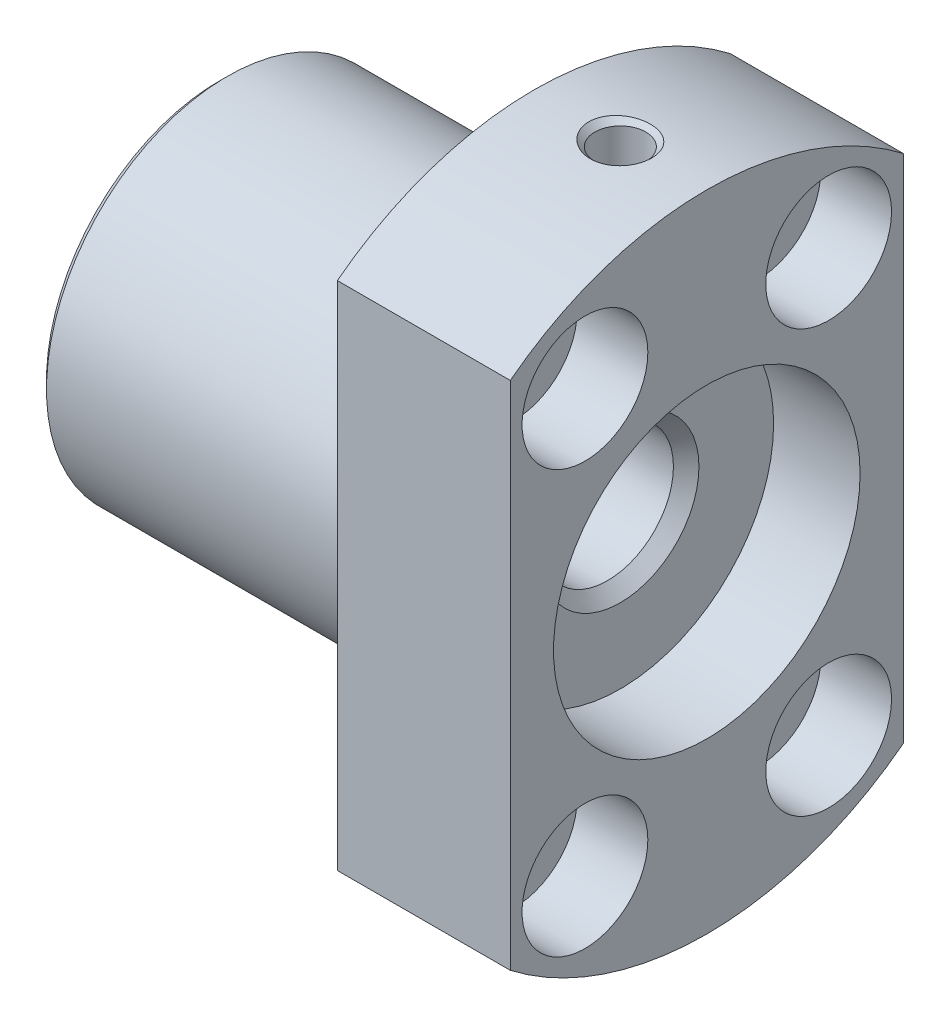
ISO-10303-21;
HEADER;
FILE_DESCRIPTION(('STEP AP214'),'2;1');
FILE_NAME('part.step','',(''),(''),'','','');
FILE_SCHEMA(('AUTOMOTIVE_DESIGN { 1 0 10303 214 1 1 1 1 }'));
ENDSEC;
DATA;
#1=APPLICATION_CONTEXT('core data for automotive mechanical design processes');
#2=APPLICATION_PROTOCOL_DEFINITION('international standard','automotive_design',2000,#1);
#3=PRODUCT_CONTEXT('',#1,'mechanical');
#4=PRODUCT('Part','Part','',(#3));
#5=PRODUCT_RELATED_PRODUCT_CATEGORY('part','',(#4));
#6=PRODUCT_DEFINITION_FORMATION('','',#4);
#7=PRODUCT_DEFINITION_CONTEXT('part definition',#1,'design');
#8=PRODUCT_DEFINITION('design','',#6,#7);
#9=PRODUCT_DEFINITION_SHAPE('','',#8);
#10=(LENGTH_UNIT() NAMED_UNIT(*) SI_UNIT(.MILLI.,.METRE.));
#11=(NAMED_UNIT(*) PLANE_ANGLE_UNIT() SI_UNIT($,.RADIAN.));
#12=(NAMED_UNIT(*) SI_UNIT($,.STERADIAN.) SOLID_ANGLE_UNIT());
#13=UNCERTAINTY_MEASURE_WITH_UNIT(LENGTH_MEASURE(1.E-05),#10,'distance_accuracy_value','');
#14=(GEOMETRIC_REPRESENTATION_CONTEXT(3) GLOBAL_UNCERTAINTY_ASSIGNED_CONTEXT((#13)) GLOBAL_UNIT_ASSIGNED_CONTEXT((#10,
#11,#12)) REPRESENTATION_CONTEXT('',''));
#15=CARTESIAN_POINT('',(0.,0.,0.));
#16=DIRECTION('',(0.,0.,1.));
#17=DIRECTION('',(1.,0.,0.));
#18=AXIS2_PLACEMENT_3D('',#15,#16,#17);
#19=CARTESIAN_POINT('',(131.999999999891,0.,0.));
#20=DIRECTION('',(1.,0.,0.));
#21=DIRECTION('',(0.,0.,-1.));
#22=AXIS2_PLACEMENT_3D('',#19,#20,#21);
#23=CONICAL_SURFACE('',#22,4.99999999988176,0.785398163397448);
#24=CARTESIAN_POINT('',(131.188,0.,0.));
#25=DIRECTION('',(1.,0.,0.));
#26=DIRECTION('',(0.,0.,-1.));
#27=AXIS2_PLACEMENT_3D('',#24,#25,#26);
#28=CIRCLE('',#27,4.188);
#29=CARTESIAN_POINT('',(131.188,0.,-4.188));
#30=VERTEX_POINT('',#29);
#31=EDGE_CURVE('E86',#30,#30,#28,.F.);
#32=ORIENTED_EDGE('',*,*,#31,.T.);
#33=EDGE_LOOP('',(#32));
#34=FACE_BOUND('',#33,.T.);
#35=CARTESIAN_POINT('',(131.999999999948,0.,0.));
#36=DIRECTION('',(1.,0.,0.));
#37=DIRECTION('',(0.,0.,-1.));
#38=AXIS2_PLACEMENT_3D('',#35,#36,#37);
#39=CIRCLE('',#38,4.99999999993861);
#40=CARTESIAN_POINT('',(131.999999999948,0.,-4.99999999993861));
#41=VERTEX_POINT('',#40);
#42=EDGE_CURVE('E20',#41,#41,#39,.T.);
#43=ORIENTED_EDGE('',*,*,#42,.T.);
#44=EDGE_LOOP('',(#43));
#45=FACE_BOUND('',#44,.T.);
#46=ADVANCED_FACE('F17',(#34,#45),#23,.F.);
#47=CARTESIAN_POINT('',(122.,0.,0.));
#48=DIRECTION('',(1.,0.,0.));
#49=DIRECTION('',(0.,0.,-1.));
#50=AXIS2_PLACEMENT_3D('',#47,#48,#49);
#51=CYLINDRICAL_SURFACE('',#50,4.188);
#52=CARTESIAN_POINT('',(112.812000000019,0.,0.));
#53=DIRECTION('',(-1.,0.,0.));
#54=DIRECTION('',(0.,1.,0.));
#55=AXIS2_PLACEMENT_3D('',#52,#53,#54);
#56=CIRCLE('',#55,4.18799999999919);
#57=CARTESIAN_POINT('',(112.812000000019,4.18799999999919,0.));
#58=VERTEX_POINT('',#57);
#59=EDGE_CURVE('E93',#58,#58,#56,.T.);
#60=ORIENTED_EDGE('',*,*,#59,.T.);
#61=EDGE_LOOP('',(#60));
#62=FACE_BOUND('',#61,.T.);
#63=ORIENTED_EDGE('',*,*,#31,.F.);
#64=EDGE_LOOP('',(#63));
#65=FACE_BOUND('',#64,.T.);
#66=ADVANCED_FACE('F370',(#62,#65),#51,.F.);
#67=CARTESIAN_POINT('',(132.,9.49999999988904,0.));
#68=DIRECTION('',(0.,1.,0.));
#69=DIRECTION('',(0.,0.,1.));
#70=AXIS2_PLACEMENT_3D('',#67,#68,#69);
#71=CONICAL_SURFACE('',#70,1.62099999983456,1.04719755104415);
#72=DIRECTION('',(0.,0.499999999999999,-0.866025403784439));
#73=VECTOR('',#72,1.);
#74=CARTESIAN_POINT('',(132.,8.56411521364362,0.));
#75=LINE('',#74,#73);
#76=CARTESIAN_POINT('',(132.000000000096,8.56411521358238,0.));
#77=VERTEX_POINT('',#76);
#78=CARTESIAN_POINT('',(132.,9.5,-1.621));
#79=VERTEX_POINT('',#78);
#80=EDGE_CURVE('E78',#77,#79,#75,.T.);
#81=ORIENTED_EDGE('',*,*,#80,.T.);
#82=CARTESIAN_POINT('',(132.,9.5,0.));
#83=DIRECTION('',(0.,-1.,0.));
#84=DIRECTION('',(0.,0.,-1.));
#85=AXIS2_PLACEMENT_3D('',#82,#83,#84);
#86=CIRCLE('',#85,1.621);
#87=CARTESIAN_POINT('',(132.,9.5,1.621));
#88=VERTEX_POINT('',#87);
#89=EDGE_CURVE('E85',#79,#88,#86,.F.);
#90=ORIENTED_EDGE('',*,*,#89,.T.);
#91=DIRECTION('',(0.,-0.499999999999999,-0.866025403784439));
#92=VECTOR('',#91,1.);
#93=CARTESIAN_POINT('',(132.,9.5,1.621));
#94=LINE('',#93,#92);
#95=EDGE_CURVE('E82',#88,#77,#94,.T.);
#96=ORIENTED_EDGE('',*,*,#95,.T.);
#97=EDGE_LOOP('',(#81,#90,#96));
#98=FACE_BOUND('',#97,.T.);
#99=ADVANCED_FACE('F83',(#98),#71,.F.);
#100=CARTESIAN_POINT('',(132.,7.375,0.));
#101=DIRECTION('',(-1.,0.,0.));
#102=DIRECTION('',(0.,0.,1.));
#103=AXIS2_PLACEMENT_3D('',#100,#101,#102);
#104=PLANE('',#103);
#105=ORIENTED_EDGE('',*,*,#42,.F.);
#106=EDGE_LOOP('',(#105));
#107=FACE_BOUND('',#106,.T.);
#108=ORIENTED_EDGE('',*,*,#80,.F.);
#109=ORIENTED_EDGE('',*,*,#95,.F.);
#110=DIRECTION('',(0.,-1.,0.));
#111=VECTOR('',#110,1.);
#112=CARTESIAN_POINT('',(132.,14.8105,1.621));
#113=LINE('',#112,#111);
#114=CARTESIAN_POINT('',(132.,9.61430491507316,1.621));
#115=VERTEX_POINT('',#114);
#116=EDGE_CURVE('E64',#88,#115,#113,.F.);
#117=ORIENTED_EDGE('',*,*,#116,.T.);
#118=CARTESIAN_POINT('',(132.,0.,0.));
#119=DIRECTION('',(1.,0.,0.));
#120=DIRECTION('',(0.,0.,-1.));
#121=AXIS2_PLACEMENT_3D('',#118,#119,#120);
#122=CIRCLE('',#121,9.75);
#123=CARTESIAN_POINT('',(132.,9.61430491507316,-1.621));
#124=VERTEX_POINT('',#123);
#125=EDGE_CURVE('E262',#115,#124,#122,.T.);
#126=ORIENTED_EDGE('',*,*,#125,.T.);
#127=DIRECTION('',(0.,-1.,0.));
#128=VECTOR('',#127,1.);
#129=CARTESIAN_POINT('',(132.,14.8105,-1.621));
#130=LINE('',#129,#128);
#131=EDGE_CURVE('E90',#124,#79,#130,.T.);
#132=ORIENTED_EDGE('',*,*,#131,.T.);
#133=EDGE_LOOP('',(#108,#109,#117,#126,#132));
#134=FACE_BOUND('',#133,.T.);
#135=ADVANCED_FACE('F88',(#107,#134),#104,.F.);
#136=CARTESIAN_POINT('',(111.999999999966,0.,0.));
#137=DIRECTION('',(-1.,0.,0.));
#138=DIRECTION('',(0.,0.,1.));
#139=AXIS2_PLACEMENT_3D('',#136,#137,#138);
#140=CONICAL_SURFACE('',#139,4.99999999999545,0.785398163362446);
#141=CARTESIAN_POINT('',(111.999999999966,0.,0.));
#142=DIRECTION('',(-1.,0.,0.));
#143=DIRECTION('',(0.,0.,1.));
#144=AXIS2_PLACEMENT_3D('',#141,#142,#143);
#145=CIRCLE('',#144,4.99999999999545);
#146=CARTESIAN_POINT('',(111.999999999966,0.,4.99999999999545));
#147=VERTEX_POINT('',#146);
#148=EDGE_CURVE('E259',#147,#147,#145,.T.);
#149=ORIENTED_EDGE('',*,*,#148,.T.);
#150=EDGE_LOOP('',(#149));
#151=FACE_BOUND('',#150,.T.);
#152=ORIENTED_EDGE('',*,*,#59,.F.);
#153=EDGE_LOOP('',(#152));
#154=FACE_BOUND('',#153,.T.);
#155=ADVANCED_FACE('F357',(#151,#154),#140,.F.);
#156=CARTESIAN_POINT('',(132.,14.8105,0.));
#157=DIRECTION('',(0.,-1.,0.));
#158=DIRECTION('',(0.,0.,-1.));
#159=AXIS2_PLACEMENT_3D('',#156,#157,#158);
#160=CYLINDRICAL_SURFACE('',#159,1.621);
#161=CARTESIAN_POINT('',(132.,20.1210000000174,0.));
#162=DIRECTION('',(0.,1.,0.));
#163=DIRECTION('',(1.,0.,0.));
#164=AXIS2_PLACEMENT_3D('',#161,#162,#163);
#165=CIRCLE('',#164,1.62100000000509);
#166=CARTESIAN_POINT('',(133.621000000005,20.1210000000174,0.));
#167=VERTEX_POINT('',#166);
#168=EDGE_CURVE('E246',#167,#167,#165,.T.);
#169=ORIENTED_EDGE('',*,*,#168,.T.);
#170=EDGE_LOOP('',(#169));
#171=FACE_BOUND('',#170,.T.);
#172=ORIENTED_EDGE('',*,*,#116,.F.);
#173=ORIENTED_EDGE('',*,*,#89,.F.);
#174=ORIENTED_EDGE('',*,*,#131,.F.);
#175=CARTESIAN_POINT('',(132.,9.61430491507316,-1.621));
#176=CARTESIAN_POINT('',(132.045269203979,9.61430303064303,-1.62100007158851));
#177=CARTESIAN_POINT('',(132.090516407201,9.61462504917856,-1.61910247087981));
#178=CARTESIAN_POINT('',(132.180680784985,9.61589714658602,-1.61153463077563));
#179=CARTESIAN_POINT('',(132.225597992039,9.61684716276499,-1.60586476796437));
#180=CARTESIAN_POINT('',(132.359247108824,9.62060429308858,-1.58326276144415));
#181=CARTESIAN_POINT('',(132.447073881136,9.62431865631016,-1.5607379712759));
#182=CARTESIAN_POINT('',(132.617632617454,9.63374552252633,-1.50144492304655));
#183=CARTESIAN_POINT('',(132.700363359932,9.63945850241821,-1.46467326526263));
#184=CARTESIAN_POINT('',(132.858493304511,9.65223582701912,-1.37795402299685));
#185=CARTESIAN_POINT('',(132.933892714049,9.6593001334758,-1.32800681146355));
#186=CARTESIAN_POINT('',(133.075927604089,9.67405997694353,-1.21584595955926));
#187=CARTESIAN_POINT('',(133.142482335011,9.68176041008872,-1.15353074513347));
#188=CARTESIAN_POINT('',(133.26426390219,9.69688411023862,-1.01859644949962));
#189=CARTESIAN_POINT('',(133.319486548912,9.7043072739086,-0.945973574217335));
#190=CARTESIAN_POINT('',(133.417337127354,9.71809318661282,-0.791944873421602));
#191=CARTESIAN_POINT('',(133.459882914279,9.7244489077617,-0.71048623901388));
#192=CARTESIAN_POINT('',(133.530611351403,9.73531707215638,-0.541515390813742));
#193=CARTESIAN_POINT('',(133.558810911405,9.73983168425338,-0.454010442663097));
#194=CARTESIAN_POINT('',(133.593224336421,9.74541162362148,-0.305032479766652));
#195=CARTESIAN_POINT('',(133.603624581942,9.74712385642843,-0.244517461256091));
#196=CARTESIAN_POINT('',(133.617513765891,9.74941861284122,-0.122676961521844));
#197=CARTESIAN_POINT('',(133.621002654469,9.75000112829876,-0.0613514744557172));
#198=CARTESIAN_POINT('',(133.620996089763,9.74999833792885,0.0903754566661628));
#199=CARTESIAN_POINT('',(133.613415683473,9.74873019437488,0.180807304833728));
#200=CARTESIAN_POINT('',(133.583304477673,9.74379288007477,0.35914106080197));
#201=CARTESIAN_POINT('',(133.560758315793,9.74012124219178,0.447040272006717));
#202=CARTESIAN_POINT('',(133.501415352203,9.73078894621008,0.617692763765222));
#203=CARTESIAN_POINT('',(133.464630902389,9.7251300125091,0.700450432653786));
#204=CARTESIAN_POINT('',(133.377885865327,9.71244539116469,0.858607752554874));
#205=CARTESIAN_POINT('',(133.327926872787,9.70541986896638,0.934008292595681));
#206=CARTESIAN_POINT('',(133.215746838106,9.69070633869562,1.076038631211));
#207=CARTESIAN_POINT('',(133.153425191897,9.6830132077447,1.14258844296441));
#208=CARTESIAN_POINT('',(133.018499774654,9.66787033959105,1.26434029291605));
#209=CARTESIAN_POINT('',(132.945894941539,9.66042062762736,1.31954115751306));
#210=CARTESIAN_POINT('',(132.791906939877,9.64655715835786,1.41735653591062));
#211=CARTESIAN_POINT('',(132.71047075671,9.64015030851885,1.4598885625114));
#212=CARTESIAN_POINT('',(132.541498571432,9.62917410035867,1.53061922295744));
#213=CARTESIAN_POINT('',(132.453966306026,9.62460362782742,1.55882655097175));
#214=CARTESIAN_POINT('',(132.304935147278,9.61895382291825,1.5932431667313));
#215=CARTESIAN_POINT('',(132.244395394148,9.61721987308319,1.60364192369505));
#216=CARTESIAN_POINT('',(132.122579754335,9.61489147372115,1.61752141109976));
#217=CARTESIAN_POINT('',(132.061304825918,9.61429567511167,1.62101033214327));
#218=CARTESIAN_POINT('',(132.,9.61430491507316,1.621));
#219=B_SPLINE_CURVE_WITH_KNOTS('',3,(#175,#176,#177,#178,#179,#180,#181,#182,#183,#184,#185,
#186,#187,#188,#189,#190,#191,#192,#193,#194,#195,#196,#197,#198,#199,#200,#201,#202,#203,#204,
#205,#206,#207,#208,#209,#210,#211,#212,#213,#214,#215,#216,#217,#218),.UNSPECIFIED.,.F.,.F.,(4,
2,2,2,2,2,2,2,2,2,2,2,2,2,2,2,2,2,2,2,2,4),(0.,0.135723191942827,0.271432836697278,
0.542267644736301,0.813167121794064,1.08405893156664,1.35727511247761,1.63059212167356,
1.90564349421806,2.1803699100275,2.3642702094965,2.54817183537525,2.8190731228812,
3.09025292187779,3.36119799432558,3.6321102853818,3.90532500292206,4.17856795955981,
4.45355295961781,4.72837086143227,4.91234419277012,5.09609931972865),.UNSPECIFIED.);
#220=EDGE_CURVE('E70',#124,#115,#219,.T.);
#221=ORIENTED_EDGE('',*,*,#220,.T.);
#222=EDGE_LOOP('',(#172,#173,#174,#221));
#223=FACE_BOUND('',#222,.T.);
#224=ADVANCED_FACE('F268',(#171,#223),#160,.F.);
#225=CARTESIAN_POINT('',(134.75,0.,0.));
#226=DIRECTION('',(1.,0.,0.));
#227=DIRECTION('',(0.,0.,-1.));
#228=AXIS2_PLACEMENT_3D('',#225,#226,#227);
#229=CYLINDRICAL_SURFACE('',#228,9.75);
#230=CARTESIAN_POINT('',(137.5,0.,0.));
#231=DIRECTION('',(1.,0.,0.));
#232=DIRECTION('',(0.,0.,-1.));
#233=AXIS2_PLACEMENT_3D('',#230,#231,#232);
#234=CIRCLE('',#233,9.75);
#235=CARTESIAN_POINT('',(137.5,0.,-9.75));
#236=VERTEX_POINT('',#235);
#237=EDGE_CURVE('E243',#236,#236,#234,.F.);
#238=ORIENTED_EDGE('',*,*,#237,.F.);
#239=EDGE_LOOP('',(#238));
#240=FACE_BOUND('',#239,.T.);
#241=ORIENTED_EDGE('',*,*,#220,.F.);
#242=ORIENTED_EDGE('',*,*,#125,.F.);
#243=EDGE_LOOP('',(#241,#242));
#244=FACE_BOUND('',#243,.T.);
#245=ADVANCED_FACE('F271',(#240,#244),#229,.F.);
#246=CARTESIAN_POINT('',(135.25,-13.4233937586588,7.75));
#247=DIRECTION('',(1.,0.,0.));
#248=DIRECTION('',(0.,0.,-1.));
#249=AXIS2_PLACEMENT_3D('',#246,#247,#248);
#250=CYLINDRICAL_SURFACE('',#249,4.);
#251=CARTESIAN_POINT('',(137.5,-13.4233937586588,7.75));
#252=DIRECTION('',(1.,0.,0.));
#253=DIRECTION('',(0.,0.,-1.));
#254=AXIS2_PLACEMENT_3D('',#251,#252,#253);
#255=CIRCLE('',#254,4.);
#256=CARTESIAN_POINT('',(137.5,-13.4233937586588,3.75));
#257=VERTEX_POINT('',#256);
#258=EDGE_CURVE('E240',#257,#257,#255,.F.);
#259=ORIENTED_EDGE('',*,*,#258,.F.);
#260=EDGE_LOOP('',(#259));
#261=FACE_BOUND('',#260,.T.);
#262=CARTESIAN_POINT('',(133.,-13.4233937586588,7.75));
#263=DIRECTION('',(1.,0.,0.));
#264=DIRECTION('',(0.,0.,-1.));
#265=AXIS2_PLACEMENT_3D('',#262,#263,#264);
#266=CIRCLE('',#265,4.);
#267=CARTESIAN_POINT('',(133.,-13.4233937586588,3.75));
#268=VERTEX_POINT('',#267);
#269=EDGE_CURVE('E256',#268,#268,#266,.F.);
#270=ORIENTED_EDGE('',*,*,#269,.T.);
#271=EDGE_LOOP('',(#270));
#272=FACE_BOUND('',#271,.T.);
#273=ADVANCED_FACE('F275',(#261,#272),#250,.F.);
#274=CARTESIAN_POINT('',(135.25,13.4233937586588,-7.75));
#275=DIRECTION('',(1.,0.,0.));
#276=DIRECTION('',(0.,0.,-1.));
#277=AXIS2_PLACEMENT_3D('',#274,#275,#276);
#278=CYLINDRICAL_SURFACE('',#277,4.);
#279=CARTESIAN_POINT('',(137.5,13.4233937586588,-7.75));
#280=DIRECTION('',(1.,0.,0.));
#281=DIRECTION('',(0.,0.,-1.));
#282=AXIS2_PLACEMENT_3D('',#279,#280,#281);
#283=CIRCLE('',#282,4.);
#284=CARTESIAN_POINT('',(137.5,13.4233937586588,-11.75));
#285=VERTEX_POINT('',#284);
#286=EDGE_CURVE('E237',#285,#285,#283,.F.);
#287=ORIENTED_EDGE('',*,*,#286,.F.);
#288=EDGE_LOOP('',(#287));
#289=FACE_BOUND('',#288,.T.);
#290=CARTESIAN_POINT('',(133.,13.4233937586588,-7.75));
#291=DIRECTION('',(1.,0.,0.));
#292=DIRECTION('',(0.,0.,-1.));
#293=AXIS2_PLACEMENT_3D('',#290,#291,#292);
#294=CIRCLE('',#293,4.);
#295=CARTESIAN_POINT('',(133.,13.4233937586588,-11.75));
#296=VERTEX_POINT('',#295);
#297=EDGE_CURVE('E253',#296,#296,#294,.F.);
#298=ORIENTED_EDGE('',*,*,#297,.T.);
#299=EDGE_LOOP('',(#298));
#300=FACE_BOUND('',#299,.T.);
#301=ADVANCED_FACE('F279',(#289,#300),#278,.F.);
#302=CARTESIAN_POINT('',(135.25,-13.4233937586588,-7.75));
#303=DIRECTION('',(1.,0.,0.));
#304=DIRECTION('',(0.,0.,-1.));
#305=AXIS2_PLACEMENT_3D('',#302,#303,#304);
#306=CYLINDRICAL_SURFACE('',#305,4.);
#307=CARTESIAN_POINT('',(137.5,-13.4233937586588,-7.75));
#308=DIRECTION('',(1.,0.,0.));
#309=DIRECTION('',(0.,0.,-1.));
#310=AXIS2_PLACEMENT_3D('',#307,#308,#309);
#311=CIRCLE('',#310,4.);
#312=CARTESIAN_POINT('',(137.5,-13.4233937586588,-11.75));
#313=VERTEX_POINT('',#312);
#314=EDGE_CURVE('E231',#313,#313,#311,.F.);
#315=ORIENTED_EDGE('',*,*,#314,.F.);
#316=EDGE_LOOP('',(#315));
#317=FACE_BOUND('',#316,.T.);
#318=CARTESIAN_POINT('',(133.,-13.4233937586588,-7.75));
#319=DIRECTION('',(1.,0.,0.));
#320=DIRECTION('',(0.,0.,-1.));
#321=AXIS2_PLACEMENT_3D('',#318,#319,#320);
#322=CIRCLE('',#321,4.);
#323=CARTESIAN_POINT('',(133.,-13.4233937586588,-11.75));
#324=VERTEX_POINT('',#323);
#325=EDGE_CURVE('E250',#324,#324,#322,.F.);
#326=ORIENTED_EDGE('',*,*,#325,.T.);
#327=EDGE_LOOP('',(#326));
#328=FACE_BOUND('',#327,.T.);
#329=ADVANCED_FACE('F283',(#317,#328),#306,.F.);
#330=CARTESIAN_POINT('',(135.25,13.4233937586588,7.75));
#331=DIRECTION('',(1.,0.,0.));
#332=DIRECTION('',(0.,0.,-1.));
#333=AXIS2_PLACEMENT_3D('',#330,#331,#332);
#334=CYLINDRICAL_SURFACE('',#333,4.);
#335=CARTESIAN_POINT('',(137.5,13.4233937586588,7.75));
#336=DIRECTION('',(1.,0.,0.));
#337=DIRECTION('',(0.,0.,-1.));
#338=AXIS2_PLACEMENT_3D('',#335,#336,#337);
#339=CIRCLE('',#338,4.);
#340=CARTESIAN_POINT('',(137.5,13.4233937586588,3.75));
#341=VERTEX_POINT('',#340);
#342=EDGE_CURVE('E225',#341,#341,#339,.F.);
#343=ORIENTED_EDGE('',*,*,#342,.F.);
#344=EDGE_LOOP('',(#343));
#345=FACE_BOUND('',#344,.T.);
#346=CARTESIAN_POINT('',(133.,13.4233937586588,7.75));
#347=DIRECTION('',(1.,0.,0.));
#348=DIRECTION('',(0.,0.,-1.));
#349=AXIS2_PLACEMENT_3D('',#346,#347,#348);
#350=CIRCLE('',#349,4.);
#351=CARTESIAN_POINT('',(133.,13.4233937586588,3.75));
#352=VERTEX_POINT('',#351);
#353=EDGE_CURVE('E247',#352,#352,#350,.F.);
#354=ORIENTED_EDGE('',*,*,#353,.T.);
#355=EDGE_LOOP('',(#354));
#356=FACE_BOUND('',#355,.T.);
#357=ADVANCED_FACE('F287',(#345,#356),#334,.F.);
#358=CARTESIAN_POINT('',(112.,7.375,0.));
#359=DIRECTION('',(1.,0.,0.));
#360=DIRECTION('',(0.,0.,-1.));
#361=AXIS2_PLACEMENT_3D('',#358,#359,#360);
#362=PLANE('',#361);
#363=ORIENTED_EDGE('',*,*,#148,.F.);
#364=EDGE_LOOP('',(#363));
#365=FACE_BOUND('',#364,.T.);
#366=CARTESIAN_POINT('',(112.,0.,0.));
#367=DIRECTION('',(1.,0.,0.));
#368=DIRECTION('',(0.,0.,-1.));
#369=AXIS2_PLACEMENT_3D('',#366,#367,#368);
#370=CIRCLE('',#369,9.75);
#371=CARTESIAN_POINT('',(112.,0.,-9.75));
#372=VERTEX_POINT('',#371);
#373=EDGE_CURVE('E222',#372,#372,#370,.F.);
#374=ORIENTED_EDGE('',*,*,#373,.T.);
#375=EDGE_LOOP('',(#374));
#376=FACE_BOUND('',#375,.T.);
#377=ADVANCED_FACE('F291',(#365,#376),#362,.F.);
#378=CARTESIAN_POINT('',(133.,-10.7170643718324,6.1875));
#379=DIRECTION('',(-1.,0.,0.));
#380=DIRECTION('',(0.,0.,1.));
#381=AXIS2_PLACEMENT_3D('',#378,#379,#380);
#382=PLANE('',#381);
#383=ORIENTED_EDGE('',*,*,#269,.F.);
#384=EDGE_LOOP('',(#383));
#385=FACE_BOUND('',#384,.T.);
#386=CARTESIAN_POINT('',(133.,-13.4233937586588,7.75));
#387=DIRECTION('',(1.,0.,0.));
#388=DIRECTION('',(0.,0.,-1.));
#389=AXIS2_PLACEMENT_3D('',#386,#387,#388);
#390=CIRCLE('',#389,2.25);
#391=CARTESIAN_POINT('',(133.,-13.4233937586588,5.5));
#392=VERTEX_POINT('',#391);
#393=EDGE_CURVE('E224',#392,#392,#390,.F.);
#394=ORIENTED_EDGE('',*,*,#393,.T.);
#395=EDGE_LOOP('',(#394));
#396=FACE_BOUND('',#395,.T.);
#397=ADVANCED_FACE('F295',(#385,#396),#382,.F.);
#398=CARTESIAN_POINT('',(133.,16.1297231454852,-9.3125));
#399=DIRECTION('',(-1.,0.,0.));
#400=DIRECTION('',(0.,0.,1.));
#401=AXIS2_PLACEMENT_3D('',#398,#399,#400);
#402=PLANE('',#401);
#403=ORIENTED_EDGE('',*,*,#297,.F.);
#404=EDGE_LOOP('',(#403));
#405=FACE_BOUND('',#404,.T.);
#406=CARTESIAN_POINT('',(133.,13.4233937586588,-7.75));
#407=DIRECTION('',(1.,0.,0.));
#408=DIRECTION('',(0.,0.,-1.));
#409=AXIS2_PLACEMENT_3D('',#406,#407,#408);
#410=CIRCLE('',#409,2.25);
#411=CARTESIAN_POINT('',(133.,13.4233937586588,-10.));
#412=VERTEX_POINT('',#411);
#413=EDGE_CURVE('E228',#412,#412,#410,.F.);
#414=ORIENTED_EDGE('',*,*,#413,.T.);
#415=EDGE_LOOP('',(#414));
#416=FACE_BOUND('',#415,.T.);
#417=ADVANCED_FACE('F299',(#405,#416),#402,.F.);
#418=CARTESIAN_POINT('',(133.,-10.7170643718324,-6.1875));
#419=DIRECTION('',(-1.,0.,0.));
#420=DIRECTION('',(0.,0.,1.));
#421=AXIS2_PLACEMENT_3D('',#418,#419,#420);
#422=PLANE('',#421);
#423=ORIENTED_EDGE('',*,*,#325,.F.);
#424=EDGE_LOOP('',(#423));
#425=FACE_BOUND('',#424,.T.);
#426=CARTESIAN_POINT('',(133.,-13.4233937586588,-7.75));
#427=DIRECTION('',(1.,0.,0.));
#428=DIRECTION('',(0.,0.,-1.));
#429=AXIS2_PLACEMENT_3D('',#426,#427,#428);
#430=CIRCLE('',#429,2.25);
#431=CARTESIAN_POINT('',(133.,-13.4233937586588,-10.));
#432=VERTEX_POINT('',#431);
#433=EDGE_CURVE('E316',#432,#432,#430,.F.);
#434=ORIENTED_EDGE('',*,*,#433,.T.);
#435=EDGE_LOOP('',(#434));
#436=FACE_BOUND('',#435,.T.);
#437=ADVANCED_FACE('F303',(#425,#436),#422,.F.);
#438=CARTESIAN_POINT('',(133.,16.1297231454852,9.3125));
#439=DIRECTION('',(-1.,0.,0.));
#440=DIRECTION('',(0.,0.,1.));
#441=AXIS2_PLACEMENT_3D('',#438,#439,#440);
#442=PLANE('',#441);
#443=ORIENTED_EDGE('',*,*,#353,.F.);
#444=EDGE_LOOP('',(#443));
#445=FACE_BOUND('',#444,.T.);
#446=CARTESIAN_POINT('',(133.,13.4233937586588,7.75));
#447=DIRECTION('',(1.,0.,0.));
#448=DIRECTION('',(0.,0.,-1.));
#449=AXIS2_PLACEMENT_3D('',#446,#447,#448);
#450=CIRCLE('',#449,2.25);
#451=CARTESIAN_POINT('',(133.,13.4233937586588,5.5));
#452=VERTEX_POINT('',#451);
#453=EDGE_CURVE('E315',#452,#452,#450,.F.);
#454=ORIENTED_EDGE('',*,*,#453,.T.);
#455=EDGE_LOOP('',(#454));
#456=FACE_BOUND('',#455,.T.);
#457=ADVANCED_FACE('F191',(#445,#456),#442,.F.);
#458=CARTESIAN_POINT('',(132.,20.5022740000231,0.));
#459=DIRECTION('',(0.,1.,0.));
#460=DIRECTION('',(0.,0.,1.));
#461=AXIS2_PLACEMENT_3D('',#458,#459,#460);
#462=CONICAL_SURFACE('',#461,2.00227400001085,0.785398163397448);
#463=CARTESIAN_POINT('',(130.000000000012,20.5,0.));
#464=CARTESIAN_POINT('',(130.000004689702,20.4999990615966,-0.0992369025892937));
#465=CARTESIAN_POINT('',(130.008143135753,20.4992716745431,-0.198588751718313));
#466=CARTESIAN_POINT('',(130.040450150132,20.4964347498538,-0.39475339862258));
#467=CARTESIAN_POINT('',(130.064649346323,20.4943225715138,-0.491560977063337));
#468=CARTESIAN_POINT('',(130.129258775053,20.488852634691,-0.68289979661906));
#469=CARTESIAN_POINT('',(130.170143125092,20.4854586847305,-0.777270334530913));
#470=CARTESIAN_POINT('',(130.266686380192,20.4778022536349,-0.958025976978908));
#471=CARTESIAN_POINT('',(130.322342316181,20.4735399470785,-1.04441268155737));
#472=CARTESIAN_POINT('',(130.448571098758,20.4644523582782,-1.20964866921276));
#473=CARTESIAN_POINT('',(130.5195434333,20.4596139679707,-1.28819180143287));
#474=CARTESIAN_POINT('',(130.673174395094,20.4499914859837,-1.43287078836928));
#475=CARTESIAN_POINT('',(130.755836055125,20.4452074087447,-1.49900341280248));
#476=CARTESIAN_POINT('',(130.934469569375,20.4359752479725,-1.62011708663318));
#477=CARTESIAN_POINT('',(131.030872122714,20.4315518586843,-1.67446492382499));
#478=CARTESIAN_POINT('',(131.231211696976,20.4237646527827,-1.76691746639261));
#479=CARTESIAN_POINT('',(131.33515013789,20.4204010365046,-1.8050191011318));
#480=CARTESIAN_POINT('',(131.551832934955,20.4149833527995,-1.86531927753836));
#481=CARTESIAN_POINT('',(131.664761688328,20.4129836670521,-1.88686134435509));
#482=CARTESIAN_POINT('',(131.892644054403,20.4107244667664,-1.91114526660473));
#483=CARTESIAN_POINT('',(132.007597926725,20.4104651769978,-1.91388469370631));
#484=CARTESIAN_POINT('',(132.238542733991,20.4117276008208,-1.90037498469597));
#485=CARTESIAN_POINT('',(132.354512885841,20.4132826977368,-1.88376993360509));
#486=CARTESIAN_POINT('',(132.582002472695,20.4180524730993,-1.83134354708825));
#487=CARTESIAN_POINT('',(132.693521699985,20.4212672289011,-1.79552131596413));
#488=CARTESIAN_POINT('',(132.908487348819,20.4289725118792,-1.70560895903387));
#489=CARTESIAN_POINT('',(133.011958227825,20.4334589647879,-1.65157707057486));
#490=CARTESIAN_POINT('',(133.208008873483,20.4431834772214,-1.52648880251531));
#491=CARTESIAN_POINT('',(133.300590553314,20.4484214043557,-1.45543542019156));
#492=CARTESIAN_POINT('',(133.469537344929,20.4588721018842,-1.30016669069082));
#493=CARTESIAN_POINT('',(133.546263264452,20.4640819471353,-1.21634419681049));
#494=CARTESIAN_POINT('',(133.683807576215,20.4739812227324,-1.03642829301796));
#495=CARTESIAN_POINT('',(133.744623277229,20.4786705649579,-0.940332811207297));
#496=CARTESIAN_POINT('',(133.845730945983,20.4867544192934,-0.743108517987457));
#497=CARTESIAN_POINT('',(133.886797759661,20.4901962166744,-0.642377985454755));
#498=CARTESIAN_POINT('',(133.950558196,20.4956359987669,-0.435377972523983));
#499=CARTESIAN_POINT('',(133.973295151006,20.4976373874389,-0.329122191365208));
#500=CARTESIAN_POINT('',(133.990963872776,20.499198356098,-0.185037355295448));
#501=CARTESIAN_POINT('',(133.994349303315,20.4994983105117,-0.148115802427543));
#502=CARTESIAN_POINT('',(133.998868186305,20.4998993027541,-0.0741348431367575));
#503=CARTESIAN_POINT('',(134.000001752081,20.5000003505926,-0.0370754437450255));
#504=CARTESIAN_POINT('',(133.999995310298,20.4999990615966,0.0992369025892938));
#505=CARTESIAN_POINT('',(133.991856864247,20.4992716745431,0.198588751718313));
#506=CARTESIAN_POINT('',(133.959549849868,20.4964347498538,0.394753398622579));
#507=CARTESIAN_POINT('',(133.935350653677,20.4943225715138,0.491560977063336));
#508=CARTESIAN_POINT('',(133.870741224947,20.488852634691,0.68289979661906));
#509=CARTESIAN_POINT('',(133.829856874908,20.4854586847305,0.777270334530913));
#510=CARTESIAN_POINT('',(133.733313619808,20.4778022536349,0.958025976978908));
#511=CARTESIAN_POINT('',(133.677657683819,20.4735399470785,1.04441268155737));
#512=CARTESIAN_POINT('',(133.551428901242,20.4644523582782,1.20964866921276));
#513=CARTESIAN_POINT('',(133.4804565667,20.4596139679707,1.28819180143287));
#514=CARTESIAN_POINT('',(133.326825604906,20.4499914859837,1.43287078836928));
#515=CARTESIAN_POINT('',(133.244163944875,20.4452074087447,1.49900341280248));
#516=CARTESIAN_POINT('',(133.065530430625,20.4359752479725,1.62011708663318));
#517=CARTESIAN_POINT('',(132.969127877286,20.4315518586843,1.67446492382499));
#518=CARTESIAN_POINT('',(132.768788303024,20.4237646527827,1.76691746639261));
#519=CARTESIAN_POINT('',(132.66484986211,20.4204010365046,1.80501910113181));
#520=CARTESIAN_POINT('',(132.448167065045,20.4149833527995,1.86531927753836));
#521=CARTESIAN_POINT('',(132.335238311672,20.4129836670521,1.88686134435508));
#522=CARTESIAN_POINT('',(132.107355945597,20.4107244667664,1.91114526660472));
#523=CARTESIAN_POINT('',(131.992402073275,20.4104651769978,1.91388469370631));
#524=CARTESIAN_POINT('',(131.761457266009,20.4117276008208,1.90037498469598));
#525=CARTESIAN_POINT('',(131.645487114159,20.4132826977368,1.8837699336051));
#526=CARTESIAN_POINT('',(131.417997527305,20.4180524730993,1.83134354708826));
#527=CARTESIAN_POINT('',(131.306478300015,20.4212672289011,1.79552131596413));
#528=CARTESIAN_POINT('',(131.091512651181,20.4289725118792,1.70560895903387));
#529=CARTESIAN_POINT('',(130.988041772175,20.4334589647879,1.65157707057486));
#530=CARTESIAN_POINT('',(130.791991126517,20.4431834772214,1.52648880251531));
#531=CARTESIAN_POINT('',(130.699409446686,20.4484214043557,1.45543542019157));
#532=CARTESIAN_POINT('',(130.530462655071,20.4588721018842,1.30016669069082));
#533=CARTESIAN_POINT('',(130.453736735548,20.4640819471353,1.21634419681049));
#534=CARTESIAN_POINT('',(130.316192423785,20.4739812227324,1.03642829301796));
#535=CARTESIAN_POINT('',(130.255376722771,20.4786705649579,0.940332811207298));
#536=CARTESIAN_POINT('',(130.154269054017,20.4867544192934,0.743108517987458));
#537=CARTESIAN_POINT('',(130.113202240339,20.4901962166744,0.642377985454755));
#538=CARTESIAN_POINT('',(130.049441804,20.4956359987669,0.435377972523984));
#539=CARTESIAN_POINT('',(130.026704848994,20.4976373874389,0.329122191365209));
#540=CARTESIAN_POINT('',(130.009036127224,20.499198356098,0.18503735529545));
#541=CARTESIAN_POINT('',(130.005650696685,20.4994983105117,0.148115802427545));
#542=CARTESIAN_POINT('',(130.001131813695,20.4998993027541,0.0741348431367587));
#543=CARTESIAN_POINT('',(129.999998247919,20.5000003505926,0.0370754437450262));
#544=CARTESIAN_POINT('',(130.000000000012,20.5,0.));
#545=B_SPLINE_CURVE_WITH_KNOTS('',3,(#463,#464,#465,#466,#467,#468,#469,#470,#471,#472,#473,
#474,#475,#476,#477,#478,#479,#480,#481,#482,#483,#484,#485,#486,#487,#488,#489,#490,#491,#492,
#493,#494,#495,#496,#497,#498,#499,#500,#501,#502,#503,#504,#505,#506,#507,#508,#509,#510,#511,
#512,#513,#514,#515,#516,#517,#518,#519,#520,#521,#522,#523,#524,#525,#526,#527,#528,#529,#530,
#531,#532,#533,#534,#535,#536,#537,#538,#539,#540,#541,#542,#543,#544),.UNSPECIFIED.,.T.,.F.,(4,
2,2,2,2,2,2,2,2,2,2,2,2,2,2,2,2,2,2,2,2,2,2,2,2,2,2,2,2,2,2,2,2,2,2,2,2,2,2,2,4),(0.,
0.297577416057363,0.595723949316736,0.903008319652397,1.21023097288886,1.52672530865003,
1.84330190958409,2.17407765306468,2.50491588760259,2.84827560123502,3.19167965839972,
3.54150304915414,3.89134274632795,4.24007405417515,4.5887439997852,4.92829457340211,
5.26790254514732,5.59280123919318,5.91692959179271,6.02811171988929,6.13928825262011,
6.43686566867748,6.73501220193685,7.04229657227251,7.34951922550897,7.66601356127014,
7.9825901622042,8.3133659056848,8.6442041402227,8.98756385385508,9.33096791101981,
9.68079130177423,10.0306309989481,10.3793623067953,10.7280322524053,11.0675828260222,
11.4071907977674,11.7320894918133,12.0562178444128,12.1673999725094,12.2785765052402),.UNSPECIFIED.);
#546=CARTESIAN_POINT('',(130.000000000012,20.5,0.));
#547=VERTEX_POINT('',#546);
#548=EDGE_CURVE('E136',#547,#547,#545,.T.);
#549=ORIENTED_EDGE('',*,*,#548,.F.);
#550=EDGE_LOOP('',(#549));
#551=FACE_BOUND('',#550,.T.);
#552=ORIENTED_EDGE('',*,*,#168,.F.);
#553=EDGE_LOOP('',(#552));
#554=FACE_BOUND('',#553,.T.);
#555=ADVANCED_FACE('F146',(#551,#554),#462,.F.);
#556=CARTESIAN_POINT('',(137.5,0.,0.));
#557=DIRECTION('',(1.,0.,0.));
#558=DIRECTION('',(0.,0.,-1.));
#559=AXIS2_PLACEMENT_3D('',#556,#557,#558);
#560=PLANE('',#559);
#561=CARTESIAN_POINT('',(137.5,0.,0.));
#562=DIRECTION('',(-1.,0.,0.));
#563=DIRECTION('',(0.,0.,1.));
#564=AXIS2_PLACEMENT_3D('',#561,#562,#563);
#565=CIRCLE('',#564,20.5);
#566=CARTESIAN_POINT('',(137.5,-16.2480768092719,-12.5));
#567=VERTEX_POINT('',#566);
#568=CARTESIAN_POINT('',(137.5,-16.2480768092719,12.5));
#569=VERTEX_POINT('',#568);
#570=EDGE_CURVE('E144',#567,#569,#565,.T.);
#571=ORIENTED_EDGE('',*,*,#570,.F.);
#572=DIRECTION('',(0.,1.,0.));
#573=VECTOR('',#572,1.);
#574=CARTESIAN_POINT('',(137.5,16.2480768092719,-12.5));
#575=LINE('',#574,#573);
#576=CARTESIAN_POINT('',(137.5,16.2480768092719,-12.5));
#577=VERTEX_POINT('',#576);
#578=EDGE_CURVE('E318',#577,#567,#575,.F.);
#579=ORIENTED_EDGE('',*,*,#578,.F.);
#580=CARTESIAN_POINT('',(137.5,0.,0.));
#581=DIRECTION('',(-1.,0.,0.));
#582=DIRECTION('',(0.,0.,1.));
#583=AXIS2_PLACEMENT_3D('',#580,#581,#582);
#584=CIRCLE('',#583,20.5);
#585=CARTESIAN_POINT('',(137.5,16.2480768092719,12.5));
#586=VERTEX_POINT('',#585);
#587=EDGE_CURVE('E132',#586,#577,#584,.T.);
#588=ORIENTED_EDGE('',*,*,#587,.F.);
#589=DIRECTION('',(0.,1.,0.));
#590=VECTOR('',#589,1.);
#591=CARTESIAN_POINT('',(137.5,-16.2480768092719,12.5));
#592=LINE('',#591,#590);
#593=EDGE_CURVE('E344',#569,#586,#592,.T.);
#594=ORIENTED_EDGE('',*,*,#593,.F.);
#595=EDGE_LOOP('',(#571,#579,#588,#594));
#596=FACE_BOUND('',#595,.T.);
#597=ORIENTED_EDGE('',*,*,#342,.T.);
#598=EDGE_LOOP('',(#597));
#599=FACE_BOUND('',#598,.T.);
#600=ORIENTED_EDGE('',*,*,#314,.T.);
#601=EDGE_LOOP('',(#600));
#602=FACE_BOUND('',#601,.T.);
#603=ORIENTED_EDGE('',*,*,#286,.T.);
#604=EDGE_LOOP('',(#603));
#605=FACE_BOUND('',#604,.T.);
#606=ORIENTED_EDGE('',*,*,#258,.T.);
#607=EDGE_LOOP('',(#606));
#608=FACE_BOUND('',#607,.T.);
#609=ORIENTED_EDGE('',*,*,#237,.T.);
#610=EDGE_LOOP('',(#609));
#611=FACE_BOUND('',#610,.T.);
#612=ADVANCED_FACE('F183',(#596,#599,#602,#605,#608,#611),#560,.T.);
#613=CARTESIAN_POINT('',(109.25,0.,0.));
#614=DIRECTION('',(1.,0.,0.));
#615=DIRECTION('',(0.,0.,-1.));
#616=AXIS2_PLACEMENT_3D('',#613,#614,#615);
#617=CYLINDRICAL_SURFACE('',#616,9.75);
#618=CARTESIAN_POINT('',(106.5,0.,0.));
#619=DIRECTION('',(1.,0.,0.));
#620=DIRECTION('',(0.,0.,-1.));
#621=AXIS2_PLACEMENT_3D('',#618,#619,#620);
#622=CIRCLE('',#621,9.75);
#623=CARTESIAN_POINT('',(106.5,0.,-9.75));
#624=VERTEX_POINT('',#623);
#625=EDGE_CURVE('E128',#624,#624,#622,.T.);
#626=ORIENTED_EDGE('',*,*,#625,.F.);
#627=EDGE_LOOP('',(#626));
#628=FACE_BOUND('',#627,.T.);
#629=ORIENTED_EDGE('',*,*,#373,.F.);
#630=EDGE_LOOP('',(#629));
#631=FACE_BOUND('',#630,.T.);
#632=ADVANCED_FACE('F180',(#628,#631),#617,.F.);
#633=CARTESIAN_POINT('',(129.75,-13.4233937586588,7.75));
#634=DIRECTION('',(1.,0.,0.));
#635=DIRECTION('',(0.,0.,-1.));
#636=AXIS2_PLACEMENT_3D('',#633,#634,#635);
#637=CYLINDRICAL_SURFACE('',#636,2.25);
#638=ORIENTED_EDGE('',*,*,#393,.F.);
#639=EDGE_LOOP('',(#638));
#640=FACE_BOUND('',#639,.T.);
#641=CARTESIAN_POINT('',(126.5,-13.4233937586588,7.75));
#642=DIRECTION('',(1.,0.,0.));
#643=DIRECTION('',(0.,0.,-1.));
#644=AXIS2_PLACEMENT_3D('',#641,#642,#643);
#645=CIRCLE('',#644,2.25);
#646=CARTESIAN_POINT('',(126.5,-13.4233937586588,5.5));
#647=VERTEX_POINT('',#646);
#648=EDGE_CURVE('E125',#647,#647,#645,.F.);
#649=ORIENTED_EDGE('',*,*,#648,.T.);
#650=EDGE_LOOP('',(#649));
#651=FACE_BOUND('',#650,.T.);
#652=ADVANCED_FACE('F176',(#640,#651),#637,.F.);
#653=CARTESIAN_POINT('',(129.75,13.4233937586588,-7.75));
#654=DIRECTION('',(1.,0.,0.));
#655=DIRECTION('',(0.,0.,-1.));
#656=AXIS2_PLACEMENT_3D('',#653,#654,#655);
#657=CYLINDRICAL_SURFACE('',#656,2.25);
#658=ORIENTED_EDGE('',*,*,#413,.F.);
#659=EDGE_LOOP('',(#658));
#660=FACE_BOUND('',#659,.T.);
#661=CARTESIAN_POINT('',(126.5,13.4233937586588,-7.75));
#662=DIRECTION('',(1.,0.,0.));
#663=DIRECTION('',(0.,0.,-1.));
#664=AXIS2_PLACEMENT_3D('',#661,#662,#663);
#665=CIRCLE('',#664,2.25);
#666=CARTESIAN_POINT('',(126.5,13.4233937586588,-10.));
#667=VERTEX_POINT('',#666);
#668=EDGE_CURVE('E122',#667,#667,#665,.F.);
#669=ORIENTED_EDGE('',*,*,#668,.T.);
#670=EDGE_LOOP('',(#669));
#671=FACE_BOUND('',#670,.T.);
#672=ADVANCED_FACE('F172',(#660,#671),#657,.F.);
#673=CARTESIAN_POINT('',(129.75,-13.4233937586588,-7.75));
#674=DIRECTION('',(1.,0.,0.));
#675=DIRECTION('',(0.,0.,-1.));
#676=AXIS2_PLACEMENT_3D('',#673,#674,#675);
#677=CYLINDRICAL_SURFACE('',#676,2.25);
#678=ORIENTED_EDGE('',*,*,#433,.F.);
#679=EDGE_LOOP('',(#678));
#680=FACE_BOUND('',#679,.T.);
#681=CARTESIAN_POINT('',(126.5,-13.4233937586588,-7.75));
#682=DIRECTION('',(1.,0.,0.));
#683=DIRECTION('',(0.,0.,-1.));
#684=AXIS2_PLACEMENT_3D('',#681,#682,#683);
#685=CIRCLE('',#684,2.25);
#686=CARTESIAN_POINT('',(126.5,-13.4233937586588,-10.));
#687=VERTEX_POINT('',#686);
#688=EDGE_CURVE('E119',#687,#687,#685,.F.);
#689=ORIENTED_EDGE('',*,*,#688,.T.);
#690=EDGE_LOOP('',(#689));
#691=FACE_BOUND('',#690,.T.);
#692=ADVANCED_FACE('F168',(#680,#691),#677,.F.);
#693=CARTESIAN_POINT('',(129.75,13.4233937586588,7.75));
#694=DIRECTION('',(1.,0.,0.));
#695=DIRECTION('',(0.,0.,-1.));
#696=AXIS2_PLACEMENT_3D('',#693,#694,#695);
#697=CYLINDRICAL_SURFACE('',#696,2.25);
#698=ORIENTED_EDGE('',*,*,#453,.F.);
#699=EDGE_LOOP('',(#698));
#700=FACE_BOUND('',#699,.T.);
#701=CARTESIAN_POINT('',(126.5,13.4233937586588,7.75));
#702=DIRECTION('',(1.,0.,0.));
#703=DIRECTION('',(0.,0.,-1.));
#704=AXIS2_PLACEMENT_3D('',#701,#702,#703);
#705=CIRCLE('',#704,2.25);
#706=CARTESIAN_POINT('',(126.5,13.4233937586588,5.5));
#707=VERTEX_POINT('',#706);
#708=EDGE_CURVE('E116',#707,#707,#705,.F.);
#709=ORIENTED_EDGE('',*,*,#708,.T.);
#710=EDGE_LOOP('',(#709));
#711=FACE_BOUND('',#710,.T.);
#712=ADVANCED_FACE('F164',(#700,#711),#697,.F.);
#713=CARTESIAN_POINT('',(126.5,0.,0.));
#714=DIRECTION('',(-1.,0.,0.));
#715=DIRECTION('',(0.,0.,1.));
#716=AXIS2_PLACEMENT_3D('',#713,#714,#715);
#717=CYLINDRICAL_SURFACE('',#716,20.5);
#718=CARTESIAN_POINT('',(126.5,0.,0.));
#719=DIRECTION('',(-1.,0.,0.));
#720=DIRECTION('',(0.,0.,1.));
#721=AXIS2_PLACEMENT_3D('',#718,#719,#720);
#722=CIRCLE('',#721,20.5);
#723=CARTESIAN_POINT('',(126.5,-16.2480768092719,12.5));
#724=VERTEX_POINT('',#723);
#725=CARTESIAN_POINT('',(126.5,-16.2480768092719,-12.5));
#726=VERTEX_POINT('',#725);
#727=EDGE_CURVE('E114',#724,#726,#722,.F.);
#728=ORIENTED_EDGE('',*,*,#727,.T.);
#729=DIRECTION('',(-1.,0.,0.));
#730=VECTOR('',#729,1.);
#731=CARTESIAN_POINT('',(126.5,-16.2480768092719,-12.5));
#732=LINE('',#731,#730);
#733=EDGE_CURVE('E143',#567,#726,#732,.T.);
#734=ORIENTED_EDGE('',*,*,#733,.F.);
#735=ORIENTED_EDGE('',*,*,#570,.T.);
#736=DIRECTION('',(1.,0.,0.));
#737=VECTOR('',#736,1.);
#738=CARTESIAN_POINT('',(126.5,-16.2480768092719,12.5));
#739=LINE('',#738,#737);
#740=EDGE_CURVE('E131',#724,#569,#739,.T.);
#741=ORIENTED_EDGE('',*,*,#740,.F.);
#742=EDGE_LOOP('',(#728,#734,#735,#741));
#743=FACE_BOUND('',#742,.T.);
#744=ADVANCED_FACE('F160',(#743),#717,.T.);
#745=CARTESIAN_POINT('',(126.5,16.2480768092719,-12.5));
#746=DIRECTION('',(0.,0.,-1.));
#747=DIRECTION('',(-1.,0.,0.));
#748=AXIS2_PLACEMENT_3D('',#745,#746,#747);
#749=PLANE('',#748);
#750=DIRECTION('',(0.,1.,0.));
#751=VECTOR('',#750,1.);
#752=CARTESIAN_POINT('',(126.5,0.,-12.5));
#753=LINE('',#752,#751);
#754=CARTESIAN_POINT('',(126.5,16.2480768092719,-12.5));
#755=VERTEX_POINT('',#754);
#756=EDGE_CURVE('E113',#726,#755,#753,.T.);
#757=ORIENTED_EDGE('',*,*,#756,.T.);
#758=DIRECTION('',(-1.,0.,0.));
#759=VECTOR('',#758,1.);
#760=CARTESIAN_POINT('',(126.5,16.2480768092719,-12.5));
#761=LINE('',#760,#759);
#762=EDGE_CURVE('E135',#577,#755,#761,.T.);
#763=ORIENTED_EDGE('',*,*,#762,.F.);
#764=ORIENTED_EDGE('',*,*,#578,.T.);
#765=ORIENTED_EDGE('',*,*,#733,.T.);
#766=EDGE_LOOP('',(#757,#763,#764,#765));
#767=FACE_BOUND('',#766,.T.);
#768=ADVANCED_FACE('F156',(#767),#749,.T.);
#769=CARTESIAN_POINT('',(126.5,0.,0.));
#770=DIRECTION('',(-1.,0.,0.));
#771=DIRECTION('',(0.,0.,1.));
#772=AXIS2_PLACEMENT_3D('',#769,#770,#771);
#773=CYLINDRICAL_SURFACE('',#772,20.5);
#774=CARTESIAN_POINT('',(126.5,0.,0.));
#775=DIRECTION('',(-1.,0.,0.));
#776=DIRECTION('',(0.,0.,1.));
#777=AXIS2_PLACEMENT_3D('',#774,#775,#776);
#778=CIRCLE('',#777,20.5);
#779=CARTESIAN_POINT('',(126.5,16.2480768092719,12.5));
#780=VERTEX_POINT('',#779);
#781=EDGE_CURVE('E35',#755,#780,#778,.F.);
#782=ORIENTED_EDGE('',*,*,#781,.T.);
#783=DIRECTION('',(1.,0.,0.));
#784=VECTOR('',#783,1.);
#785=CARTESIAN_POINT('',(126.5,16.2480768092719,12.5));
#786=LINE('',#785,#784);
#787=EDGE_CURVE('E652',#586,#780,#786,.F.);
#788=ORIENTED_EDGE('',*,*,#787,.F.);
#789=ORIENTED_EDGE('',*,*,#587,.T.);
#790=ORIENTED_EDGE('',*,*,#762,.T.);
#791=EDGE_LOOP('',(#782,#788,#789,#790));
#792=FACE_BOUND('',#791,.T.);
#793=ORIENTED_EDGE('',*,*,#548,.T.);
#794=EDGE_LOOP('',(#793));
#795=FACE_BOUND('',#794,.T.);
#796=ADVANCED_FACE('F150',(#792,#795),#773,.T.);
#797=CARTESIAN_POINT('',(126.5,-16.2480768092719,12.5));
#798=DIRECTION('',(0.,0.,1.));
#799=DIRECTION('',(1.,0.,0.));
#800=AXIS2_PLACEMENT_3D('',#797,#798,#799);
#801=PLANE('',#800);
#802=DIRECTION('',(0.,1.,0.));
#803=VECTOR('',#802,1.);
#804=CARTESIAN_POINT('',(126.5,0.,12.5));
#805=LINE('',#804,#803);
#806=EDGE_CURVE('E111',#780,#724,#805,.F.);
#807=ORIENTED_EDGE('',*,*,#806,.T.);
#808=ORIENTED_EDGE('',*,*,#740,.T.);
#809=ORIENTED_EDGE('',*,*,#593,.T.);
#810=ORIENTED_EDGE('',*,*,#787,.T.);
#811=EDGE_LOOP('',(#807,#808,#809,#810));
#812=FACE_BOUND('',#811,.T.);
#813=ADVANCED_FACE('F155',(#812),#801,.T.);
#814=CARTESIAN_POINT('',(106.5,5.5,0.));
#815=DIRECTION('',(-1.,0.,0.));
#816=DIRECTION('',(0.,0.,1.));
#817=AXIS2_PLACEMENT_3D('',#814,#815,#816);
#818=PLANE('',#817);
#819=CARTESIAN_POINT('',(106.5,0.,0.));
#820=DIRECTION('',(1.,0.,0.));
#821=DIRECTION('',(0.,0.,-1.));
#822=AXIS2_PLACEMENT_3D('',#819,#820,#821);
#823=CIRCLE('',#822,11.);
#824=CARTESIAN_POINT('',(106.5,0.,-11.));
#825=VERTEX_POINT('',#824);
#826=EDGE_CURVE('E108',#825,#825,#823,.T.);
#827=ORIENTED_EDGE('',*,*,#826,.F.);
#828=EDGE_LOOP('',(#827));
#829=FACE_BOUND('',#828,.T.);
#830=ORIENTED_EDGE('',*,*,#625,.T.);
#831=EDGE_LOOP('',(#830));
#832=FACE_BOUND('',#831,.T.);
#833=ADVANCED_FACE('F208',(#829,#832),#818,.T.);
#834=CARTESIAN_POINT('',(126.5,0.,0.));
#835=DIRECTION('',(1.,0.,0.));
#836=DIRECTION('',(0.,0.,-1.));
#837=AXIS2_PLACEMENT_3D('',#834,#835,#836);
#838=PLANE('',#837);
#839=CARTESIAN_POINT('',(126.5,0.,0.));
#840=DIRECTION('',(1.,0.,0.));
#841=DIRECTION('',(0.,0.,-1.));
#842=AXIS2_PLACEMENT_3D('',#839,#840,#841);
#843=CIRCLE('',#842,11.5);
#844=CARTESIAN_POINT('',(126.5,0.,-11.5));
#845=VERTEX_POINT('',#844);
#846=EDGE_CURVE('E26',#845,#845,#843,.F.);
#847=ORIENTED_EDGE('',*,*,#846,.F.);
#848=EDGE_LOOP('',(#847));
#849=FACE_BOUND('',#848,.T.);
#850=ORIENTED_EDGE('',*,*,#781,.F.);
#851=ORIENTED_EDGE('',*,*,#756,.F.);
#852=ORIENTED_EDGE('',*,*,#727,.F.);
#853=ORIENTED_EDGE('',*,*,#806,.F.);
#854=EDGE_LOOP('',(#850,#851,#852,#853));
#855=FACE_BOUND('',#854,.T.);
#856=ORIENTED_EDGE('',*,*,#708,.F.);
#857=EDGE_LOOP('',(#856));
#858=FACE_BOUND('',#857,.T.);
#859=ORIENTED_EDGE('',*,*,#688,.F.);
#860=EDGE_LOOP('',(#859));
#861=FACE_BOUND('',#860,.T.);
#862=ORIENTED_EDGE('',*,*,#668,.F.);
#863=EDGE_LOOP('',(#862));
#864=FACE_BOUND('',#863,.T.);
#865=ORIENTED_EDGE('',*,*,#648,.F.);
#866=EDGE_LOOP('',(#865));
#867=FACE_BOUND('',#866,.T.);
#868=ADVANCED_FACE('F202',(#849,#855,#858,#861,#864,#867),#838,.F.);
#869=CARTESIAN_POINT('',(107.,0.,0.));
#870=DIRECTION('',(1.,0.,0.));
#871=DIRECTION('',(0.,0.,-1.));
#872=AXIS2_PLACEMENT_3D('',#869,#870,#871);
#873=CONICAL_SURFACE('',#872,11.5,0.785398163397447);
#874=ORIENTED_EDGE('',*,*,#826,.T.);
#875=EDGE_LOOP('',(#874));
#876=FACE_BOUND('',#875,.T.);
#877=CARTESIAN_POINT('',(107.,0.,0.));
#878=DIRECTION('',(1.,0.,0.));
#879=DIRECTION('',(0.,0.,-1.));
#880=AXIS2_PLACEMENT_3D('',#877,#878,#879);
#881=CIRCLE('',#880,11.5);
#882=CARTESIAN_POINT('',(107.,0.,-11.5));
#883=VERTEX_POINT('',#882);
#884=EDGE_CURVE('E11',#883,#883,#881,.T.);
#885=ORIENTED_EDGE('',*,*,#884,.F.);
#886=EDGE_LOOP('',(#885));
#887=FACE_BOUND('',#886,.T.);
#888=ADVANCED_FACE('F196',(#876,#887),#873,.T.);
#889=CARTESIAN_POINT('',(116.75,0.,0.));
#890=DIRECTION('',(1.,0.,0.));
#891=DIRECTION('',(0.,0.,-1.));
#892=AXIS2_PLACEMENT_3D('',#889,#890,#891);
#893=CYLINDRICAL_SURFACE('',#892,11.5);
#894=ORIENTED_EDGE('',*,*,#846,.T.);
#895=EDGE_LOOP('',(#894));
#896=FACE_BOUND('',#895,.T.);
#897=ORIENTED_EDGE('',*,*,#884,.T.);
#898=EDGE_LOOP('',(#897));
#899=FACE_BOUND('',#898,.T.);
#900=ADVANCED_FACE('F194',(#896,#899),#893,.T.);
#901=CLOSED_SHELL('',(#46,#66,#99,#135,#155,#224,#245,#273,#301,#329,#357,#377,#397,#417,#437,
#457,#555,#612,#632,#652,#672,#692,#712,#744,#768,#796,#813,#833,#868,#888,#900));
#902=MANIFOLD_SOLID_BREP('B1',#901);
#903=ADVANCED_BREP_SHAPE_REPRESENTATION('',(#18,#902),#14);
#904=SHAPE_DEFINITION_REPRESENTATION(#9,#903);
ENDSEC;
END-ISO-10303-21;
